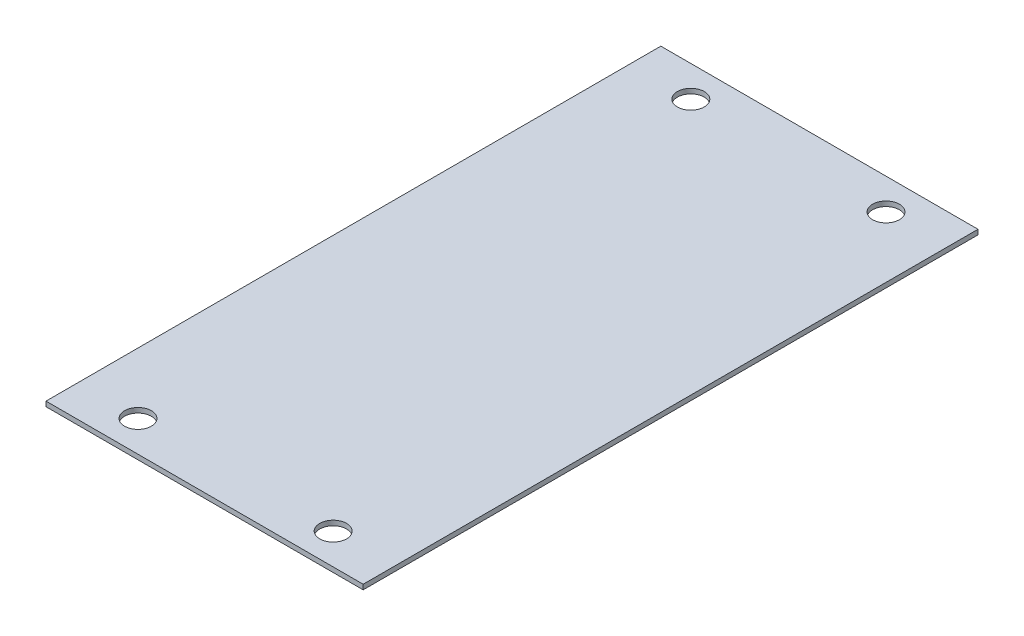
ISO-10303-21;
HEADER;
FILE_DESCRIPTION(('STEP AP214'),'2;1');
FILE_NAME('part.step','',(''),(''),'','','');
FILE_SCHEMA(('AUTOMOTIVE_DESIGN { 1 0 10303 214 1 1 1 1 }'));
ENDSEC;
DATA;
#1=APPLICATION_CONTEXT('core data for automotive mechanical design processes');
#2=APPLICATION_PROTOCOL_DEFINITION('international standard','automotive_design',2000,#1);
#3=PRODUCT_CONTEXT('',#1,'mechanical');
#4=PRODUCT('Part','Part','',(#3));
#5=PRODUCT_RELATED_PRODUCT_CATEGORY('part','',(#4));
#6=PRODUCT_DEFINITION_FORMATION('','',#4);
#7=PRODUCT_DEFINITION_CONTEXT('part definition',#1,'design');
#8=PRODUCT_DEFINITION('design','',#6,#7);
#9=PRODUCT_DEFINITION_SHAPE('','',#8);
#10=(LENGTH_UNIT() NAMED_UNIT(*) SI_UNIT(.MILLI.,.METRE.));
#11=(NAMED_UNIT(*) PLANE_ANGLE_UNIT() SI_UNIT($,.RADIAN.));
#12=(NAMED_UNIT(*) SI_UNIT($,.STERADIAN.) SOLID_ANGLE_UNIT());
#13=UNCERTAINTY_MEASURE_WITH_UNIT(LENGTH_MEASURE(1.E-05),#10,'distance_accuracy_value','');
#14=(GEOMETRIC_REPRESENTATION_CONTEXT(3) GLOBAL_UNCERTAINTY_ASSIGNED_CONTEXT((#13)) GLOBAL_UNIT_ASSIGNED_CONTEXT((#10,
#11,#12)) REPRESENTATION_CONTEXT('',''));
#15=CARTESIAN_POINT('',(0.,0.,0.));
#16=DIRECTION('',(0.,0.,1.));
#17=DIRECTION('',(1.,0.,0.));
#18=AXIS2_PLACEMENT_3D('',#15,#16,#17);
#19=CARTESIAN_POINT('',(0.,2.,0.));
#20=DIRECTION('',(0.,1.,0.));
#21=DIRECTION('',(0.,0.,1.));
#22=AXIS2_PLACEMENT_3D('',#19,#20,#21);
#23=PLANE('',#22);
#24=CARTESIAN_POINT('',(40.,2.,113.3));
#25=DIRECTION('',(0.,1.,0.));
#26=DIRECTION('',(0.,0.,1.));
#27=AXIS2_PLACEMENT_3D('',#24,#25,#26);
#28=CIRCLE('',#27,5.5);
#29=CARTESIAN_POINT('',(40.,2.,118.8));
#30=VERTEX_POINT('',#29);
#31=EDGE_CURVE('E121',#30,#30,#28,.T.);
#32=ORIENTED_EDGE('',*,*,#31,.F.);
#33=EDGE_LOOP('',(#32));
#34=FACE_BOUND('',#33,.T.);
#35=CARTESIAN_POINT('',(-40.,2.,-113.3));
#36=DIRECTION('',(0.,1.,0.));
#37=DIRECTION('',(0.,0.,1.));
#38=AXIS2_PLACEMENT_3D('',#35,#36,#37);
#39=CIRCLE('',#38,5.5);
#40=CARTESIAN_POINT('',(-40.,2.,-107.8));
#41=VERTEX_POINT('',#40);
#42=EDGE_CURVE('E100',#41,#41,#39,.T.);
#43=ORIENTED_EDGE('',*,*,#42,.F.);
#44=EDGE_LOOP('',(#43));
#45=FACE_BOUND('',#44,.T.);
#46=DIRECTION('',(0.,0.,-1.));
#47=VECTOR('',#46,1.);
#48=CARTESIAN_POINT('',(65.,2.,-126.));
#49=LINE('',#48,#47);
#50=CARTESIAN_POINT('',(65.,2.,126.));
#51=VERTEX_POINT('',#50);
#52=CARTESIAN_POINT('',(65.,2.,-126.));
#53=VERTEX_POINT('',#52);
#54=EDGE_CURVE('E85',#51,#53,#49,.T.);
#55=ORIENTED_EDGE('',*,*,#54,.T.);
#56=DIRECTION('',(-1.,0.,0.));
#57=VECTOR('',#56,1.);
#58=CARTESIAN_POINT('',(-65.,2.,-126.));
#59=LINE('',#58,#57);
#60=CARTESIAN_POINT('',(-65.,2.,-126.));
#61=VERTEX_POINT('',#60);
#62=EDGE_CURVE('E80',#53,#61,#59,.T.);
#63=ORIENTED_EDGE('',*,*,#62,.T.);
#64=DIRECTION('',(0.,0.,1.));
#65=VECTOR('',#64,1.);
#66=CARTESIAN_POINT('',(-65.,2.,-126.));
#67=LINE('',#66,#65);
#68=CARTESIAN_POINT('',(-65.,2.,126.));
#69=VERTEX_POINT('',#68);
#70=EDGE_CURVE('E83',#61,#69,#67,.T.);
#71=ORIENTED_EDGE('',*,*,#70,.T.);
#72=DIRECTION('',(1.,0.,0.));
#73=VECTOR('',#72,1.);
#74=CARTESIAN_POINT('',(-65.,2.,126.));
#75=LINE('',#74,#73);
#76=EDGE_CURVE('E50',#69,#51,#75,.T.);
#77=ORIENTED_EDGE('',*,*,#76,.T.);
#78=EDGE_LOOP('',(#55,#63,#71,#77));
#79=FACE_BOUND('',#78,.T.);
#80=CARTESIAN_POINT('',(40.,2.,-113.3));
#81=DIRECTION('',(0.,1.,0.));
#82=DIRECTION('',(0.,0.,1.));
#83=AXIS2_PLACEMENT_3D('',#80,#81,#82);
#84=CIRCLE('',#83,5.5);
#85=CARTESIAN_POINT('',(40.,2.,-107.8));
#86=VERTEX_POINT('',#85);
#87=EDGE_CURVE('E115',#86,#86,#84,.T.);
#88=ORIENTED_EDGE('',*,*,#87,.F.);
#89=EDGE_LOOP('',(#88));
#90=FACE_BOUND('',#89,.T.);
#91=CARTESIAN_POINT('',(-40.,2.,113.3));
#92=DIRECTION('',(0.,1.,0.));
#93=DIRECTION('',(0.,0.,1.));
#94=AXIS2_PLACEMENT_3D('',#91,#92,#93);
#95=CIRCLE('',#94,5.5);
#96=CARTESIAN_POINT('',(-40.,2.,118.8));
#97=VERTEX_POINT('',#96);
#98=EDGE_CURVE('E127',#97,#97,#95,.T.);
#99=ORIENTED_EDGE('',*,*,#98,.F.);
#100=EDGE_LOOP('',(#99));
#101=FACE_BOUND('',#100,.T.);
#102=ADVANCED_FACE('F33',(#34,#45,#79,#90,#101),#23,.T.);
#103=CARTESIAN_POINT('',(0.,0.,0.));
#104=DIRECTION('',(0.,1.,0.));
#105=DIRECTION('',(0.,0.,1.));
#106=AXIS2_PLACEMENT_3D('',#103,#104,#105);
#107=PLANE('',#106);
#108=DIRECTION('',(0.,0.,-1.));
#109=VECTOR('',#108,1.);
#110=CARTESIAN_POINT('',(65.,0.,-126.));
#111=LINE('',#110,#109);
#112=CARTESIAN_POINT('',(65.,0.,126.));
#113=VERTEX_POINT('',#112);
#114=CARTESIAN_POINT('',(65.,0.,-126.));
#115=VERTEX_POINT('',#114);
#116=EDGE_CURVE('E97',#113,#115,#111,.T.);
#117=ORIENTED_EDGE('',*,*,#116,.F.);
#118=DIRECTION('',(1.,0.,0.));
#119=VECTOR('',#118,1.);
#120=CARTESIAN_POINT('',(-65.,0.,126.));
#121=LINE('',#120,#119);
#122=CARTESIAN_POINT('',(-65.,0.,126.));
#123=VERTEX_POINT('',#122);
#124=EDGE_CURVE('E73',#123,#113,#121,.T.);
#125=ORIENTED_EDGE('',*,*,#124,.F.);
#126=DIRECTION('',(0.,0.,1.));
#127=VECTOR('',#126,1.);
#128=CARTESIAN_POINT('',(-65.,0.,-126.));
#129=LINE('',#128,#127);
#130=CARTESIAN_POINT('',(-65.,0.,-126.));
#131=VERTEX_POINT('',#130);
#132=EDGE_CURVE('E67',#131,#123,#129,.T.);
#133=ORIENTED_EDGE('',*,*,#132,.F.);
#134=DIRECTION('',(-1.,0.,0.));
#135=VECTOR('',#134,1.);
#136=CARTESIAN_POINT('',(-65.,0.,-126.));
#137=LINE('',#136,#135);
#138=EDGE_CURVE('E89',#115,#131,#137,.T.);
#139=ORIENTED_EDGE('',*,*,#138,.F.);
#140=EDGE_LOOP('',(#117,#125,#133,#139));
#141=FACE_BOUND('',#140,.T.);
#142=CARTESIAN_POINT('',(-40.,0.,-113.3));
#143=DIRECTION('',(0.,1.,0.));
#144=DIRECTION('',(0.,0.,1.));
#145=AXIS2_PLACEMENT_3D('',#142,#143,#144);
#146=CIRCLE('',#145,5.5);
#147=CARTESIAN_POINT('',(-40.,0.,-107.8));
#148=VERTEX_POINT('',#147);
#149=EDGE_CURVE('E112',#148,#148,#146,.T.);
#150=ORIENTED_EDGE('',*,*,#149,.T.);
#151=EDGE_LOOP('',(#150));
#152=FACE_BOUND('',#151,.T.);
#153=CARTESIAN_POINT('',(40.,0.,-113.3));
#154=DIRECTION('',(0.,1.,0.));
#155=DIRECTION('',(0.,0.,1.));
#156=AXIS2_PLACEMENT_3D('',#153,#154,#155);
#157=CIRCLE('',#156,5.5);
#158=CARTESIAN_POINT('',(40.,0.,-107.8));
#159=VERTEX_POINT('',#158);
#160=EDGE_CURVE('E118',#159,#159,#157,.T.);
#161=ORIENTED_EDGE('',*,*,#160,.T.);
#162=EDGE_LOOP('',(#161));
#163=FACE_BOUND('',#162,.T.);
#164=CARTESIAN_POINT('',(40.,0.,113.3));
#165=DIRECTION('',(0.,1.,0.));
#166=DIRECTION('',(0.,0.,1.));
#167=AXIS2_PLACEMENT_3D('',#164,#165,#166);
#168=CIRCLE('',#167,5.5);
#169=CARTESIAN_POINT('',(40.,0.,118.8));
#170=VERTEX_POINT('',#169);
#171=EDGE_CURVE('E124',#170,#170,#168,.T.);
#172=ORIENTED_EDGE('',*,*,#171,.T.);
#173=EDGE_LOOP('',(#172));
#174=FACE_BOUND('',#173,.T.);
#175=CARTESIAN_POINT('',(-40.,0.,113.3));
#176=DIRECTION('',(0.,1.,0.));
#177=DIRECTION('',(0.,0.,1.));
#178=AXIS2_PLACEMENT_3D('',#175,#176,#177);
#179=CIRCLE('',#178,5.5);
#180=CARTESIAN_POINT('',(-40.,0.,118.8));
#181=VERTEX_POINT('',#180);
#182=EDGE_CURVE('E130',#181,#181,#179,.T.);
#183=ORIENTED_EDGE('',*,*,#182,.T.);
#184=EDGE_LOOP('',(#183));
#185=FACE_BOUND('',#184,.T.);
#186=ADVANCED_FACE('F108',(#141,#152,#163,#174,#185),#107,.F.);
#187=CARTESIAN_POINT('',(65.,2.,-126.));
#188=DIRECTION('',(-1.,0.,0.));
#189=DIRECTION('',(0.,0.,1.));
#190=AXIS2_PLACEMENT_3D('',#187,#188,#189);
#191=PLANE('',#190);
#192=ORIENTED_EDGE('',*,*,#116,.T.);
#193=DIRECTION('',(0.,-1.,0.));
#194=VECTOR('',#193,1.);
#195=CARTESIAN_POINT('',(65.,2.,-126.));
#196=LINE('',#195,#194);
#197=EDGE_CURVE('E11',#53,#115,#196,.T.);
#198=ORIENTED_EDGE('',*,*,#197,.F.);
#199=ORIENTED_EDGE('',*,*,#54,.F.);
#200=DIRECTION('',(0.,-1.,0.));
#201=VECTOR('',#200,1.);
#202=CARTESIAN_POINT('',(65.,2.,126.));
#203=LINE('',#202,#201);
#204=EDGE_CURVE('E93',#51,#113,#203,.T.);
#205=ORIENTED_EDGE('',*,*,#204,.T.);
#206=EDGE_LOOP('',(#192,#198,#199,#205));
#207=FACE_BOUND('',#206,.T.);
#208=ADVANCED_FACE('F35',(#207),#191,.F.);
#209=CARTESIAN_POINT('',(-65.,2.,-126.));
#210=DIRECTION('',(0.,0.,1.));
#211=DIRECTION('',(1.,0.,0.));
#212=AXIS2_PLACEMENT_3D('',#209,#210,#211);
#213=PLANE('',#212);
#214=ORIENTED_EDGE('',*,*,#138,.T.);
#215=DIRECTION('',(0.,-1.,0.));
#216=VECTOR('',#215,1.);
#217=CARTESIAN_POINT('',(-65.,2.,-126.));
#218=LINE('',#217,#216);
#219=EDGE_CURVE('E42',#61,#131,#218,.T.);
#220=ORIENTED_EDGE('',*,*,#219,.F.);
#221=ORIENTED_EDGE('',*,*,#62,.F.);
#222=ORIENTED_EDGE('',*,*,#197,.T.);
#223=EDGE_LOOP('',(#214,#220,#221,#222));
#224=FACE_BOUND('',#223,.T.);
#225=ADVANCED_FACE('F88',(#224),#213,.F.);
#226=CARTESIAN_POINT('',(-65.,2.,-126.));
#227=DIRECTION('',(1.,0.,0.));
#228=DIRECTION('',(0.,0.,-1.));
#229=AXIS2_PLACEMENT_3D('',#226,#227,#228);
#230=PLANE('',#229);
#231=ORIENTED_EDGE('',*,*,#132,.T.);
#232=DIRECTION('',(0.,-1.,0.));
#233=VECTOR('',#232,1.);
#234=CARTESIAN_POINT('',(-65.,2.,126.));
#235=LINE('',#234,#233);
#236=EDGE_CURVE('E90',#69,#123,#235,.T.);
#237=ORIENTED_EDGE('',*,*,#236,.F.);
#238=ORIENTED_EDGE('',*,*,#70,.F.);
#239=ORIENTED_EDGE('',*,*,#219,.T.);
#240=EDGE_LOOP('',(#231,#237,#238,#239));
#241=FACE_BOUND('',#240,.T.);
#242=ADVANCED_FACE('F91',(#241),#230,.F.);
#243=CARTESIAN_POINT('',(-65.,2.,126.));
#244=DIRECTION('',(0.,0.,-1.));
#245=DIRECTION('',(-1.,0.,0.));
#246=AXIS2_PLACEMENT_3D('',#243,#244,#245);
#247=PLANE('',#246);
#248=ORIENTED_EDGE('',*,*,#124,.T.);
#249=ORIENTED_EDGE('',*,*,#204,.F.);
#250=ORIENTED_EDGE('',*,*,#76,.F.);
#251=ORIENTED_EDGE('',*,*,#236,.T.);
#252=EDGE_LOOP('',(#248,#249,#250,#251));
#253=FACE_BOUND('',#252,.T.);
#254=ADVANCED_FACE('F105',(#253),#247,.F.);
#255=CARTESIAN_POINT('',(-40.,2.,-113.3));
#256=DIRECTION('',(0.,-1.,0.));
#257=DIRECTION('',(0.,0.,-1.));
#258=AXIS2_PLACEMENT_3D('',#255,#256,#257);
#259=CYLINDRICAL_SURFACE('',#258,5.5);
#260=ORIENTED_EDGE('',*,*,#42,.T.);
#261=EDGE_LOOP('',(#260));
#262=FACE_BOUND('',#261,.T.);
#263=ORIENTED_EDGE('',*,*,#149,.F.);
#264=EDGE_LOOP('',(#263));
#265=FACE_BOUND('',#264,.T.);
#266=ADVANCED_FACE('F149',(#262,#265),#259,.F.);
#267=CARTESIAN_POINT('',(40.,2.,-113.3));
#268=DIRECTION('',(0.,-1.,0.));
#269=DIRECTION('',(0.,0.,-1.));
#270=AXIS2_PLACEMENT_3D('',#267,#268,#269);
#271=CYLINDRICAL_SURFACE('',#270,5.5);
#272=ORIENTED_EDGE('',*,*,#87,.T.);
#273=EDGE_LOOP('',(#272));
#274=FACE_BOUND('',#273,.T.);
#275=ORIENTED_EDGE('',*,*,#160,.F.);
#276=EDGE_LOOP('',(#275));
#277=FACE_BOUND('',#276,.T.);
#278=ADVANCED_FACE('F195',(#274,#277),#271,.F.);
#279=CARTESIAN_POINT('',(40.,2.,113.3));
#280=DIRECTION('',(0.,-1.,0.));
#281=DIRECTION('',(0.,0.,-1.));
#282=AXIS2_PLACEMENT_3D('',#279,#280,#281);
#283=CYLINDRICAL_SURFACE('',#282,5.5);
#284=ORIENTED_EDGE('',*,*,#31,.T.);
#285=EDGE_LOOP('',(#284));
#286=FACE_BOUND('',#285,.T.);
#287=ORIENTED_EDGE('',*,*,#171,.F.);
#288=EDGE_LOOP('',(#287));
#289=FACE_BOUND('',#288,.T.);
#290=ADVANCED_FACE('F203',(#286,#289),#283,.F.);
#291=CARTESIAN_POINT('',(-40.,2.,113.3));
#292=DIRECTION('',(0.,-1.,0.));
#293=DIRECTION('',(0.,0.,-1.));
#294=AXIS2_PLACEMENT_3D('',#291,#292,#293);
#295=CYLINDRICAL_SURFACE('',#294,5.5);
#296=ORIENTED_EDGE('',*,*,#98,.T.);
#297=EDGE_LOOP('',(#296));
#298=FACE_BOUND('',#297,.T.);
#299=ORIENTED_EDGE('',*,*,#182,.F.);
#300=EDGE_LOOP('',(#299));
#301=FACE_BOUND('',#300,.T.);
#302=ADVANCED_FACE('F136',(#298,#301),#295,.F.);
#303=CLOSED_SHELL('',(#102,#186,#208,#225,#242,#254,#266,#278,#290,#302));
#304=MANIFOLD_SOLID_BREP('B2',#303);
#305=ADVANCED_BREP_SHAPE_REPRESENTATION('',(#18,#304),#14);
#306=SHAPE_DEFINITION_REPRESENTATION(#9,#305);
ENDSEC;
END-ISO-10303-21;
